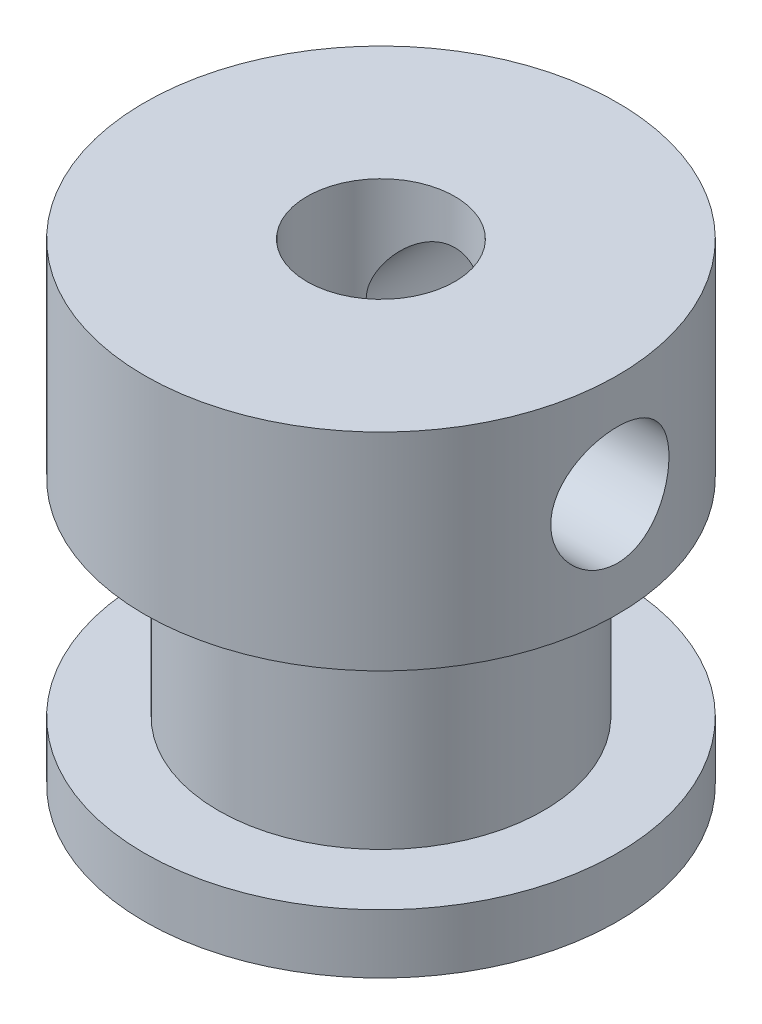
ISO-10303-21;
HEADER;
FILE_DESCRIPTION(('STEP AP214'),'2;1');
FILE_NAME('part.step','',(''),(''),'','','');
FILE_SCHEMA(('AUTOMOTIVE_DESIGN { 1 0 10303 214 1 1 1 1 }'));
ENDSEC;
DATA;
#1=APPLICATION_CONTEXT('core data for automotive mechanical design processes');
#2=APPLICATION_PROTOCOL_DEFINITION('international standard','automotive_design',2000,#1);
#3=PRODUCT_CONTEXT('',#1,'mechanical');
#4=PRODUCT('Part','Part','',(#3));
#5=PRODUCT_RELATED_PRODUCT_CATEGORY('part','',(#4));
#6=PRODUCT_DEFINITION_FORMATION('','',#4);
#7=PRODUCT_DEFINITION_CONTEXT('part definition',#1,'design');
#8=PRODUCT_DEFINITION('design','',#6,#7);
#9=PRODUCT_DEFINITION_SHAPE('','',#8);
#10=(LENGTH_UNIT() NAMED_UNIT(*) SI_UNIT(.MILLI.,.METRE.));
#11=(NAMED_UNIT(*) PLANE_ANGLE_UNIT() SI_UNIT($,.RADIAN.));
#12=(NAMED_UNIT(*) SI_UNIT($,.STERADIAN.) SOLID_ANGLE_UNIT());
#13=UNCERTAINTY_MEASURE_WITH_UNIT(LENGTH_MEASURE(1.E-05),#10,'distance_accuracy_value','');
#14=(GEOMETRIC_REPRESENTATION_CONTEXT(3) GLOBAL_UNCERTAINTY_ASSIGNED_CONTEXT((#13)) GLOBAL_UNIT_ASSIGNED_CONTEXT((#10,
#11,#12)) REPRESENTATION_CONTEXT('',''));
#15=CARTESIAN_POINT('',(0.,0.,0.));
#16=DIRECTION('',(0.,0.,1.));
#17=DIRECTION('',(1.,0.,0.));
#18=AXIS2_PLACEMENT_3D('',#15,#16,#17);
#19=CARTESIAN_POINT('',(0.,2.,0.));
#20=DIRECTION('',(0.,-1.,0.));
#21=DIRECTION('',(0.,0.,-1.));
#22=AXIS2_PLACEMENT_3D('',#19,#20,#21);
#23=CYLINDRICAL_SURFACE('',#22,8.);
#24=CARTESIAN_POINT('',(0.,2.,0.));
#25=DIRECTION('',(0.,1.,0.));
#26=DIRECTION('',(0.,0.,1.));
#27=AXIS2_PLACEMENT_3D('',#24,#25,#26);
#28=CIRCLE('',#27,8.);
#29=CARTESIAN_POINT('',(0.,2.,8.));
#30=VERTEX_POINT('',#29);
#31=EDGE_CURVE('E125',#30,#30,#28,.T.);
#32=ORIENTED_EDGE('',*,*,#31,.F.);
#33=EDGE_LOOP('',(#32));
#34=FACE_BOUND('',#33,.T.);
#35=CARTESIAN_POINT('',(0.,0.,0.));
#36=DIRECTION('',(0.,1.,0.));
#37=DIRECTION('',(0.,0.,1.));
#38=AXIS2_PLACEMENT_3D('',#35,#36,#37);
#39=CIRCLE('',#38,8.);
#40=CARTESIAN_POINT('',(0.,0.,8.));
#41=VERTEX_POINT('',#40);
#42=EDGE_CURVE('E76',#41,#41,#39,.T.);
#43=ORIENTED_EDGE('',*,*,#42,.T.);
#44=EDGE_LOOP('',(#43));
#45=FACE_BOUND('',#44,.T.);
#46=ADVANCED_FACE('F37',(#34,#45),#23,.T.);
#47=CARTESIAN_POINT('',(0.,2.,0.));
#48=DIRECTION('',(0.,1.,0.));
#49=DIRECTION('',(0.,0.,1.));
#50=AXIS2_PLACEMENT_3D('',#47,#48,#49);
#51=PLANE('',#50);
#52=CARTESIAN_POINT('',(0.,2.,0.));
#53=DIRECTION('',(0.,1.,0.));
#54=DIRECTION('',(0.,0.,1.));
#55=AXIS2_PLACEMENT_3D('',#52,#53,#54);
#56=CIRCLE('',#55,5.5);
#57=CARTESIAN_POINT('',(0.,2.,5.5));
#58=VERTEX_POINT('',#57);
#59=EDGE_CURVE('E44',#58,#58,#56,.T.);
#60=ORIENTED_EDGE('',*,*,#59,.F.);
#61=EDGE_LOOP('',(#60));
#62=FACE_BOUND('',#61,.T.);
#63=ORIENTED_EDGE('',*,*,#31,.T.);
#64=EDGE_LOOP('',(#63));
#65=FACE_BOUND('',#64,.T.);
#66=ADVANCED_FACE('F109',(#62,#65),#51,.T.);
#67=CARTESIAN_POINT('',(0.,0.,0.));
#68=DIRECTION('',(0.,1.,0.));
#69=DIRECTION('',(0.,0.,1.));
#70=AXIS2_PLACEMENT_3D('',#67,#68,#69);
#71=PLANE('',#70);
#72=CARTESIAN_POINT('',(0.,0.,0.));
#73=DIRECTION('',(0.,1.,0.));
#74=DIRECTION('',(0.,0.,1.));
#75=AXIS2_PLACEMENT_3D('',#72,#73,#74);
#76=CIRCLE('',#75,2.5);
#77=CARTESIAN_POINT('',(0.,0.,2.5));
#78=VERTEX_POINT('',#77);
#79=EDGE_CURVE('E93',#78,#78,#76,.T.);
#80=ORIENTED_EDGE('',*,*,#79,.T.);
#81=EDGE_LOOP('',(#80));
#82=FACE_BOUND('',#81,.T.);
#83=ORIENTED_EDGE('',*,*,#42,.F.);
#84=EDGE_LOOP('',(#83));
#85=FACE_BOUND('',#84,.T.);
#86=ADVANCED_FACE('F107',(#82,#85),#71,.F.);
#87=CARTESIAN_POINT('',(0.,9.,0.));
#88=DIRECTION('',(0.,-1.,0.));
#89=DIRECTION('',(0.,0.,-1.));
#90=AXIS2_PLACEMENT_3D('',#87,#88,#89);
#91=CYLINDRICAL_SURFACE('',#90,5.5);
#92=CARTESIAN_POINT('',(0.,9.,0.));
#93=DIRECTION('',(0.,1.,0.));
#94=DIRECTION('',(0.,0.,1.));
#95=AXIS2_PLACEMENT_3D('',#92,#93,#94);
#96=CIRCLE('',#95,5.5);
#97=CARTESIAN_POINT('',(0.,9.,5.5));
#98=VERTEX_POINT('',#97);
#99=EDGE_CURVE('E128',#98,#98,#96,.T.);
#100=ORIENTED_EDGE('',*,*,#99,.F.);
#101=EDGE_LOOP('',(#100));
#102=FACE_BOUND('',#101,.T.);
#103=ORIENTED_EDGE('',*,*,#59,.T.);
#104=EDGE_LOOP('',(#103));
#105=FACE_BOUND('',#104,.T.);
#106=ADVANCED_FACE('F101',(#102,#105),#91,.T.);
#107=CARTESIAN_POINT('',(0.,16.,0.));
#108=DIRECTION('',(0.,-1.,0.));
#109=DIRECTION('',(0.,0.,-1.));
#110=AXIS2_PLACEMENT_3D('',#107,#108,#109);
#111=CYLINDRICAL_SURFACE('',#110,8.);
#112=CARTESIAN_POINT('',(8.00000000000003,10.5,0.));
#113=CARTESIAN_POINT('',(7.99999813157352,10.5000031009842,0.110501451559669));
#114=CARTESIAN_POINT('',(7.99768770842436,10.5091887343651,0.221037543774378));
#115=CARTESIAN_POINT('',(7.98869485106525,10.545633535076,0.438941765027404));
#116=CARTESIAN_POINT('',(7.98200993893301,10.5729029460505,0.546308062494346));
#117=CARTESIAN_POINT('',(7.96500835109376,10.6445856712828,0.754694496243463));
#118=CARTESIAN_POINT('',(7.95469603789411,10.688978398287,0.855722084573363));
#119=CARTESIAN_POINT('',(7.93153791743495,10.7935751867265,1.0488961758726));
#120=CARTESIAN_POINT('',(7.91869202472208,10.853779781492,1.14104237913171));
#121=CARTESIAN_POINT('',(7.8915655145559,10.9896010528722,1.31573590306791));
#122=CARTESIAN_POINT('',(7.87726276197501,11.0654820999454,1.39807425341477));
#123=CARTESIAN_POINT('',(7.84898160157248,11.229936273212,1.54899856960445));
#124=CARTESIAN_POINT('',(7.83500323053156,11.3185108305959,1.61758298259895));
#125=CARTESIAN_POINT('',(7.80873034264224,11.507460302316,1.74003539039866));
#126=CARTESIAN_POINT('',(7.79646392619747,11.6079909744116,1.79366962123355));
#127=CARTESIAN_POINT('',(7.77532659757355,11.8169978822134,1.88319587806768));
#128=CARTESIAN_POINT('',(7.76645514259224,11.9254728444427,1.91909074058688));
#129=CARTESIAN_POINT('',(7.7533396892843,12.1449913309355,1.97140644907305));
#130=CARTESIAN_POINT('',(7.74900654662681,12.255939861384,1.98820302444276));
#131=CARTESIAN_POINT('',(7.74519149946121,12.4791580919991,2.00301570008857));
#132=CARTESIAN_POINT('',(7.74570880570571,12.5914275742562,2.00103485575751));
#133=CARTESIAN_POINT('',(7.75145607355755,12.8112210769938,1.97864869951963));
#134=CARTESIAN_POINT('',(7.75657150676391,12.9187941619538,1.95869112025421));
#135=CARTESIAN_POINT('',(7.77075612894758,13.1290147345481,1.90163224920402));
#136=CARTESIAN_POINT('',(7.77982559958984,13.2316618707052,1.86452973609255));
#137=CARTESIAN_POINT('',(7.80100151874211,13.4303173550028,1.77385263724961));
#138=CARTESIAN_POINT('',(7.81313769959754,13.5262482290528,1.72011555631059));
#139=CARTESIAN_POINT('',(7.83906281127987,13.7078916130091,1.59780836801996));
#140=CARTESIAN_POINT('',(7.85285203112837,13.7936023307563,1.52923566507848));
#141=CARTESIAN_POINT('',(7.88101174053188,13.9549381542592,1.37688456624165));
#142=CARTESIAN_POINT('',(7.89538759304001,14.0302059867485,1.29272834422117));
#143=CARTESIAN_POINT('',(7.92274620771675,14.1656283232852,1.11281589000496));
#144=CARTESIAN_POINT('',(7.93572892732543,14.2257823656848,1.01705930361062));
#145=CARTESIAN_POINT('',(7.9589030945892,14.3294007816325,0.816154518241884));
#146=CARTESIAN_POINT('',(7.96908480170303,14.3728071203392,0.71097519094486));
#147=CARTESIAN_POINT('',(7.98543889321888,14.4412230742794,0.494501344190539));
#148=CARTESIAN_POINT('',(7.99161204452373,14.4662362085575,0.383207998867342));
#149=CARTESIAN_POINT('',(7.999139990285,14.4966100874118,0.160719960520065));
#150=CARTESIAN_POINT('',(8.00061404677705,14.5024573681004,0.0495956266509754));
#151=CARTESIAN_POINT('',(7.99891739752601,14.4956679972594,-0.172043833068648));
#152=CARTESIAN_POINT('',(7.99574710989129,14.4830330096012,-0.282559012859431));
#153=CARTESIAN_POINT('',(7.98519441503143,14.4400387888115,-0.498152358368626));
#154=CARTESIAN_POINT('',(7.97787512247749,14.4099449820307,-0.603286825291644));
#155=CARTESIAN_POINT('',(7.95984942178846,14.3331905546287,-0.807009723269986));
#156=CARTESIAN_POINT('',(7.94914267159857,14.2865282609158,-0.905597492043484));
#157=CARTESIAN_POINT('',(7.92524410568414,14.1770184948337,-1.09536417923977));
#158=CARTESIAN_POINT('',(7.91201156489243,14.1138985168043,-1.18638058911441));
#159=CARTESIAN_POINT('',(7.88459345583226,13.9736134549374,-1.3567021515243));
#160=CARTESIAN_POINT('',(7.87040772335607,13.8964459471775,-1.43600527863065));
#161=CARTESIAN_POINT('',(7.84225275947695,13.7279973855407,-1.58265409076361));
#162=CARTESIAN_POINT('',(7.82829738916375,13.6364163959968,-1.64965849016268));
#163=CARTESIAN_POINT('',(7.80257171169652,13.4430231540457,-1.76734767868357));
#164=CARTESIAN_POINT('',(7.79080130756035,13.3412113560537,-1.81803319221055));
#165=CARTESIAN_POINT('',(7.77090792979554,13.1307923701159,-1.90126856081236));
#166=CARTESIAN_POINT('',(7.76276340389208,13.0222298288747,-1.93392586220539));
#167=CARTESIAN_POINT('',(7.75102325453579,12.8009204828145,-1.98046087993834));
#168=CARTESIAN_POINT('',(7.74742663626582,12.6881745986233,-1.99434270330485));
#169=CARTESIAN_POINT('',(7.7452653493861,12.4651719681931,-2.0027181204453));
#170=CARTESIAN_POINT('',(7.74655910304352,12.354936753167,-1.99775719704013));
#171=CARTESIAN_POINT('',(7.75370545343791,12.1369281484427,-1.9698363710838));
#172=CARTESIAN_POINT('',(7.7595579585581,12.0291547093151,-1.946876830249));
#173=CARTESIAN_POINT('',(7.77508347576964,11.8197220545795,-1.8839084259237));
#174=CARTESIAN_POINT('',(7.78473353648413,11.7180302596797,-1.84400187290714));
#175=CARTESIAN_POINT('',(7.80677007633105,11.5227128230484,-1.74835321814007));
#176=CARTESIAN_POINT('',(7.81915693494365,11.4290883024174,-1.69260892004556));
#177=CARTESIAN_POINT('',(7.8456751235135,11.2499271613306,-1.56515699818282));
#178=CARTESIAN_POINT('',(7.8598435310901,11.1646652354347,-1.49307088388298));
#179=CARTESIAN_POINT('',(7.88810702995048,11.0072706069395,-1.33571916158629));
#180=CARTESIAN_POINT('',(7.90220210302747,10.935141026516,-1.25045042834817));
#181=CARTESIAN_POINT('',(7.92903540863551,10.8047849219139,-1.06729011560343));
#182=CARTESIAN_POINT('',(7.94174444487824,10.7468338484379,-0.969197896421822));
#183=CARTESIAN_POINT('',(7.96406566633491,10.6483367160793,-0.764354746013941));
#184=CARTESIAN_POINT('',(7.97368006933042,10.607778185802,-0.657610084582292));
#185=CARTESIAN_POINT('',(7.98730746087389,10.5512375595605,-0.459213670991268));
#186=CARTESIAN_POINT('',(7.9920344673692,10.5320650092621,-0.368506894544063));
#187=CARTESIAN_POINT('',(7.99838140309265,10.5064454085041,-0.185208095381683));
#188=CARTESIAN_POINT('',(8.00000156601195,10.4999974009263,-0.092616214990127));
#189=CARTESIAN_POINT('',(8.00000000000003,10.5,0.));
#190=B_SPLINE_CURVE_WITH_KNOTS('',3,(#112,#113,#114,#115,#116,#117,#118,#119,#120,#121,#122,
#123,#124,#125,#126,#127,#128,#129,#130,#131,#132,#133,#134,#135,#136,#137,#138,#139,#140,#141,
#142,#143,#144,#145,#146,#147,#148,#149,#150,#151,#152,#153,#154,#155,#156,#157,#158,#159,#160,
#161,#162,#163,#164,#165,#166,#167,#168,#169,#170,#171,#172,#173,#174,#175,#176,#177,#178,#179,
#180,#181,#182,#183,#184,#185,#186,#187,#188,#189),.UNSPECIFIED.,.T.,.F.,(4,2,2,2,2,2,2,2,2,2,2,
2,2,2,2,2,2,2,2,2,2,2,2,2,2,2,2,2,2,2,2,2,2,2,2,2,2,2,4),(0.,0.331164949962519,
0.662517650351866,0.993473203048142,1.32443992022577,1.66152580582852,1.99864972773416,
2.34078196727742,2.68285948225824,3.01808393468093,3.3532538415469,3.68029996013785,
4.00736937959145,4.337740371696,4.66816921119311,5.00802001296453,5.34788119415424,
5.68890972016579,6.02987298255951,6.36211078603462,6.69431868154751,7.02160366023144,
7.34892169767481,7.68204783424897,8.01523150681786,8.35659345610395,8.69794025003772,
9.03723006156476,9.37644564340971,9.70591707202577,10.0353818794581,10.3628853408369,
10.6904342418696,11.0265276855097,11.3627009303165,11.7049624733721,12.0469781843289,
12.3245632392729,12.6021274139515),.UNSPECIFIED.);
#191=CARTESIAN_POINT('',(8.00000000000003,10.5,0.));
#192=VERTEX_POINT('',#191);
#193=EDGE_CURVE('E60',#192,#192,#190,.T.);
#194=ORIENTED_EDGE('',*,*,#193,.T.);
#195=EDGE_LOOP('',(#194));
#196=FACE_BOUND('',#195,.T.);
#197=CARTESIAN_POINT('',(0.,14.5,-8.));
#198=CARTESIAN_POINT('',(-0.110501451559641,14.4999968990158,-7.9999981315735));
#199=CARTESIAN_POINT('',(-0.221037543774351,14.490811265635,-7.99768770842435));
#200=CARTESIAN_POINT('',(-0.438941765027377,14.454366464924,-7.98869485106526));
#201=CARTESIAN_POINT('',(-0.546308062494319,14.4270970539495,-7.98200993893301));
#202=CARTESIAN_POINT('',(-0.754694496243435,14.3554143287172,-7.96500835109376));
#203=CARTESIAN_POINT('',(-0.855722084573335,14.311021601713,-7.95469603789411));
#204=CARTESIAN_POINT('',(-1.04889617587257,14.2064248132735,-7.93153791743495));
#205=CARTESIAN_POINT('',(-1.14104237913168,14.146220218508,-7.91869202472209));
#206=CARTESIAN_POINT('',(-1.31573590306789,14.0103989471278,-7.89156551455591));
#207=CARTESIAN_POINT('',(-1.39807425341474,13.9345179000546,-7.87726276197502));
#208=CARTESIAN_POINT('',(-1.54899856960443,13.770063726788,-7.84898160157248));
#209=CARTESIAN_POINT('',(-1.61758298259892,13.6814891694041,-7.83500323053157));
#210=CARTESIAN_POINT('',(-1.74003539039863,13.492539697684,-7.80873034264225));
#211=CARTESIAN_POINT('',(-1.79366962123352,13.3920090255884,-7.79646392619748));
#212=CARTESIAN_POINT('',(-1.88319587806766,13.1830021177866,-7.77532659757355));
#213=CARTESIAN_POINT('',(-1.91909074058685,13.0745271555573,-7.76645514259224));
#214=CARTESIAN_POINT('',(-1.97140644907302,12.8550086690645,-7.7533396892843));
#215=CARTESIAN_POINT('',(-1.98820302444274,12.744060138616,-7.74900654662681));
#216=CARTESIAN_POINT('',(-2.00301570008854,12.5208419080009,-7.74519149946122));
#217=CARTESIAN_POINT('',(-2.00103485575748,12.4085724257438,-7.74570880570571));
#218=CARTESIAN_POINT('',(-1.97864869951961,12.1887789230062,-7.75145607355756));
#219=CARTESIAN_POINT('',(-1.95869112025418,12.0812058380462,-7.75657150676391));
#220=CARTESIAN_POINT('',(-1.90163224920399,11.8709852654519,-7.77075612894758));
#221=CARTESIAN_POINT('',(-1.86452973609252,11.7683381292948,-7.77982559958985));
#222=CARTESIAN_POINT('',(-1.77385263724958,11.5696826449972,-7.80100151874212));
#223=CARTESIAN_POINT('',(-1.72011555631056,11.4737517709472,-7.81313769959755));
#224=CARTESIAN_POINT('',(-1.59780836801993,11.2921083869909,-7.83906281127988));
#225=CARTESIAN_POINT('',(-1.52923566507845,11.2063976692437,-7.85285203112837));
#226=CARTESIAN_POINT('',(-1.37688456624163,11.0450618457408,-7.88101174053188));
#227=CARTESIAN_POINT('',(-1.29272834422115,10.9697940132515,-7.89538759304001));
#228=CARTESIAN_POINT('',(-1.11281589000493,10.8343716767148,-7.92274620771675));
#229=CARTESIAN_POINT('',(-1.01705930361059,10.7742176343152,-7.93572892732543));
#230=CARTESIAN_POINT('',(-0.816154518241856,10.6705992183675,-7.9589030945892));
#231=CARTESIAN_POINT('',(-0.710975190944832,10.6271928796608,-7.96908480170303));
#232=CARTESIAN_POINT('',(-0.494501344190511,10.5587769257206,-7.98543889321888));
#233=CARTESIAN_POINT('',(-0.383207998867313,10.5337637914425,-7.99161204452374));
#234=CARTESIAN_POINT('',(-0.160719960520036,10.5033899125882,-7.999139990285));
#235=CARTESIAN_POINT('',(-0.0495956266509467,10.4975426318996,-8.00061404677705));
#236=CARTESIAN_POINT('',(0.172043833068677,10.5043320027407,-7.99891739752601));
#237=CARTESIAN_POINT('',(0.28255901285946,10.5169669903988,-7.99574710989128));
#238=CARTESIAN_POINT('',(0.498152358368655,10.5599612111885,-7.98519441503143));
#239=CARTESIAN_POINT('',(0.603286825291673,10.5900550179693,-7.97787512247748));
#240=CARTESIAN_POINT('',(0.807009723270015,10.6668094453713,-7.95984942178845));
#241=CARTESIAN_POINT('',(0.905597492043513,10.7134717390842,-7.94914267159856));
#242=CARTESIAN_POINT('',(1.0953641792398,10.8229815051663,-7.92524410568414));
#243=CARTESIAN_POINT('',(1.18638058911444,10.8861014831957,-7.91201156489243));
#244=CARTESIAN_POINT('',(1.35670215152433,11.0263865450626,-7.88459345583226));
#245=CARTESIAN_POINT('',(1.43600527863068,11.1035540528225,-7.87040772335606));
#246=CARTESIAN_POINT('',(1.58265409076364,11.2720026144593,-7.84225275947695));
#247=CARTESIAN_POINT('',(1.64965849016271,11.3635836040032,-7.82829738916375));
#248=CARTESIAN_POINT('',(1.7673476786836,11.5569768459543,-7.80257171169652));
#249=CARTESIAN_POINT('',(1.81803319221058,11.6587886439463,-7.79080130756035));
#250=CARTESIAN_POINT('',(1.90126856081239,11.8692076298841,-7.77090792979553));
#251=CARTESIAN_POINT('',(1.93392586220542,11.9777701711253,-7.76276340389207));
#252=CARTESIAN_POINT('',(1.98046087993837,12.1990795171855,-7.75102325453578));
#253=CARTESIAN_POINT('',(1.99434270330488,12.3118254013767,-7.74742663626581));
#254=CARTESIAN_POINT('',(2.00271812044533,12.5348280318069,-7.74526534938609));
#255=CARTESIAN_POINT('',(1.99775719704016,12.645063246833,-7.74655910304351));
#256=CARTESIAN_POINT('',(1.96983637108382,12.8630718515573,-7.7537054534379));
#257=CARTESIAN_POINT('',(1.94687683024903,12.9708452906849,-7.75955795855809));
#258=CARTESIAN_POINT('',(1.88390842592373,13.1802779454205,-7.77508347576963));
#259=CARTESIAN_POINT('',(1.84400187290717,13.2819697403203,-7.78473353648412));
#260=CARTESIAN_POINT('',(1.74835321814009,13.4772871769516,-7.80677007633105));
#261=CARTESIAN_POINT('',(1.69260892004558,13.5709116975826,-7.81915693494364));
#262=CARTESIAN_POINT('',(1.56515699818285,13.7500728386694,-7.8456751235135));
#263=CARTESIAN_POINT('',(1.49307088388301,13.8353347645653,-7.85984353109009));
#264=CARTESIAN_POINT('',(1.33571916158631,13.9927293930605,-7.88810702995048));
#265=CARTESIAN_POINT('',(1.25045042834819,14.064858973484,-7.90220210302746));
#266=CARTESIAN_POINT('',(1.06729011560345,14.1952150780861,-7.92903540863551));
#267=CARTESIAN_POINT('',(0.969197896421849,14.2531661515621,-7.94174444487824));
#268=CARTESIAN_POINT('',(0.764354746013968,14.3516632839207,-7.96406566633491));
#269=CARTESIAN_POINT('',(0.657610084582319,14.392221814198,-7.97368006933042));
#270=CARTESIAN_POINT('',(0.459213670991295,14.4487624404395,-7.98730746087389));
#271=CARTESIAN_POINT('',(0.368506894544091,14.4679349907379,-7.9920344673692));
#272=CARTESIAN_POINT('',(0.18520809538171,14.4935545914959,-7.99838140309264));
#273=CARTESIAN_POINT('',(0.0926162149901548,14.5000025990737,-8.00000156601192));
#274=CARTESIAN_POINT('',(0.,14.5,-8.));
#275=B_SPLINE_CURVE_WITH_KNOTS('',3,(#197,#198,#199,#200,#201,#202,#203,#204,#205,#206,#207,
#208,#209,#210,#211,#212,#213,#214,#215,#216,#217,#218,#219,#220,#221,#222,#223,#224,#225,#226,
#227,#228,#229,#230,#231,#232,#233,#234,#235,#236,#237,#238,#239,#240,#241,#242,#243,#244,#245,
#246,#247,#248,#249,#250,#251,#252,#253,#254,#255,#256,#257,#258,#259,#260,#261,#262,#263,#264,
#265,#266,#267,#268,#269,#270,#271,#272,#273,#274),.UNSPECIFIED.,.T.,.F.,(4,2,2,2,2,2,2,2,2,2,2,
2,2,2,2,2,2,2,2,2,2,2,2,2,2,2,2,2,2,2,2,2,2,2,2,2,2,2,4),(0.,0.331164949962519,
0.662517650351866,0.99347320304814,1.32443992022577,1.66152580582852,1.99864972773416,
2.34078196727742,2.68285948225824,3.01808393468093,3.3532538415469,3.68029996013785,
4.00736937959146,4.337740371696,4.66816921119311,5.00802001296453,5.34788119415424,
5.68890972016579,6.02987298255951,6.36211078603462,6.69431868154751,7.02160366023144,
7.34892169767481,7.68204783424897,8.01523150681786,8.35659345610395,8.69794025003772,
9.03723006156476,9.37644564340971,9.70591707202578,10.0353818794581,10.3628853408369,
10.6904342418696,11.0265276855097,11.3627009303165,11.7049624733721,12.0469781843289,
12.3245632392729,12.6021274139515),.UNSPECIFIED.);
#276=CARTESIAN_POINT('',(0.,14.5,-8.));
#277=VERTEX_POINT('',#276);
#278=EDGE_CURVE('E64',#277,#277,#275,.T.);
#279=ORIENTED_EDGE('',*,*,#278,.T.);
#280=EDGE_LOOP('',(#279));
#281=FACE_BOUND('',#280,.T.);
#282=CARTESIAN_POINT('',(0.,16.,0.));
#283=DIRECTION('',(0.,1.,0.));
#284=DIRECTION('',(0.,0.,1.));
#285=AXIS2_PLACEMENT_3D('',#282,#283,#284);
#286=CIRCLE('',#285,8.);
#287=CARTESIAN_POINT('',(0.,16.,8.));
#288=VERTEX_POINT('',#287);
#289=EDGE_CURVE('E130',#288,#288,#286,.T.);
#290=ORIENTED_EDGE('',*,*,#289,.F.);
#291=EDGE_LOOP('',(#290));
#292=FACE_BOUND('',#291,.T.);
#293=CARTESIAN_POINT('',(0.,9.,0.));
#294=DIRECTION('',(0.,1.,0.));
#295=DIRECTION('',(0.,0.,1.));
#296=AXIS2_PLACEMENT_3D('',#293,#294,#295);
#297=CIRCLE('',#296,8.);
#298=CARTESIAN_POINT('',(0.,9.,8.));
#299=VERTEX_POINT('',#298);
#300=EDGE_CURVE('E135',#299,#299,#297,.T.);
#301=ORIENTED_EDGE('',*,*,#300,.T.);
#302=EDGE_LOOP('',(#301));
#303=FACE_BOUND('',#302,.T.);
#304=ADVANCED_FACE('F95',(#196,#281,#292,#303),#111,.T.);
#305=CARTESIAN_POINT('',(0.,16.,0.));
#306=DIRECTION('',(0.,1.,0.));
#307=DIRECTION('',(0.,0.,1.));
#308=AXIS2_PLACEMENT_3D('',#305,#306,#307);
#309=PLANE('',#308);
#310=CARTESIAN_POINT('',(0.,16.,0.));
#311=DIRECTION('',(0.,1.,0.));
#312=DIRECTION('',(0.,0.,1.));
#313=AXIS2_PLACEMENT_3D('',#310,#311,#312);
#314=CIRCLE('',#313,2.5);
#315=CARTESIAN_POINT('',(0.,16.,2.5));
#316=VERTEX_POINT('',#315);
#317=EDGE_CURVE('E66',#316,#316,#314,.T.);
#318=ORIENTED_EDGE('',*,*,#317,.F.);
#319=EDGE_LOOP('',(#318));
#320=FACE_BOUND('',#319,.T.);
#321=ORIENTED_EDGE('',*,*,#289,.T.);
#322=EDGE_LOOP('',(#321));
#323=FACE_BOUND('',#322,.T.);
#324=ADVANCED_FACE('F100',(#320,#323),#309,.T.);
#325=CARTESIAN_POINT('',(0.,9.,0.));
#326=DIRECTION('',(0.,1.,0.));
#327=DIRECTION('',(0.,0.,1.));
#328=AXIS2_PLACEMENT_3D('',#325,#326,#327);
#329=PLANE('',#328);
#330=ORIENTED_EDGE('',*,*,#99,.T.);
#331=EDGE_LOOP('',(#330));
#332=FACE_BOUND('',#331,.T.);
#333=ORIENTED_EDGE('',*,*,#300,.F.);
#334=EDGE_LOOP('',(#333));
#335=FACE_BOUND('',#334,.T.);
#336=ADVANCED_FACE('F103',(#332,#335),#329,.F.);
#337=CARTESIAN_POINT('',(0.,0.,0.));
#338=DIRECTION('',(0.,1.,0.));
#339=DIRECTION('',(0.,0.,1.));
#340=AXIS2_PLACEMENT_3D('',#337,#338,#339);
#341=CYLINDRICAL_SURFACE('',#340,2.5);
#342=CARTESIAN_POINT('',(2.,12.5,-1.5));
#343=CARTESIAN_POINT('',(1.9999899563842,12.4249189826114,-1.5000227575991));
#344=CARTESIAN_POINT('',(1.99572243014959,12.3497210739064,-1.50575588676017));
#345=CARTESIAN_POINT('',(1.97904350434638,12.2016854705704,-1.52759797098302));
#346=CARTESIAN_POINT('',(1.96660415938922,12.1288567781879,-1.54374252679463));
#347=CARTESIAN_POINT('',(1.9288828901246,11.9623945804915,-1.59078313764401));
#348=CARTESIAN_POINT('',(1.90063587852784,11.8703574929004,-1.62485949442395));
#349=CARTESIAN_POINT('',(1.83286412912234,11.6940318598387,-1.70094533012843));
#350=CARTESIAN_POINT('',(1.79330760683741,11.6097660503329,-1.74297705283045));
#351=CARTESIAN_POINT('',(1.68777756612173,11.4196603432195,-1.84624966659378));
#352=CARTESIAN_POINT('',(1.61742363711761,11.3170334258727,-1.90894188114929));
#353=CARTESIAN_POINT('',(1.4586193506474,11.1260231647878,-2.03287996747903));
#354=CARTESIAN_POINT('',(1.37018407682201,11.0376280578861,-2.0941269976447));
#355=CARTESIAN_POINT('',(1.19476026278806,10.8928950804225,-2.1979067439451));
#356=CARTESIAN_POINT('',(1.11093376146689,10.8336737173159,-2.24174680788007));
#357=CARTESIAN_POINT('',(0.932444755507564,10.7276340400337,-2.32165152523267));
#358=CARTESIAN_POINT('',(0.837799422094952,10.6807964517991,-2.35772824500368));
#359=CARTESIAN_POINT('',(0.655317082222549,10.6082870394193,-2.41415644696378));
#360=CARTESIAN_POINT('',(0.568853585755696,10.5804174354239,-2.43610736091393));
#361=CARTESIAN_POINT('',(0.391188052921992,10.536501304746,-2.47085912284979));
#362=CARTESIAN_POINT('',(0.299988637312623,10.52044831209,-2.48366497483986));
#363=CARTESIAN_POINT('',(0.115048335136528,10.5011419067099,-2.49907968883617));
#364=CARTESIAN_POINT('',(0.0212997713727013,10.4979328073114,-2.50165324772141));
#365=CARTESIAN_POINT('',(-0.165416366428141,10.5046642348722,-2.49626936144757));
#366=CARTESIAN_POINT('',(-0.258383904122233,10.5146053703685,-2.48831142893578));
#367=CARTESIAN_POINT('',(-0.435683568436098,10.546067986313,-2.4632836571348));
#368=CARTESIAN_POINT('',(-0.520210188917499,10.5669288169561,-2.44673404857181));
#369=CARTESIAN_POINT('',(-0.684171862172426,10.6186952342522,-2.40604493660584));
#370=CARTESIAN_POINT('',(-0.76360562412977,10.6496033554976,-2.38190351809567));
#371=CARTESIAN_POINT('',(-0.923527318234433,10.7236006985885,-2.32486221996811));
#372=CARTESIAN_POINT('',(-1.00337969293305,10.7675765160147,-2.29134265660255));
#373=CARTESIAN_POINT('',(-1.15470891362336,10.8645378595917,-2.21894043646479));
#374=CARTESIAN_POINT('',(-1.22618103296473,10.9175284293631,-2.18005477975512));
#375=CARTESIAN_POINT('',(-1.37426521356107,11.0430618687988,-2.09053510980241));
#376=CARTESIAN_POINT('',(-1.44890108738507,11.1173836142049,-2.03913144290366));
#377=CARTESIAN_POINT('',(-1.58538384993671,11.2762559036507,-1.9349237792571));
#378=CARTESIAN_POINT('',(-1.6472149443604,11.3608188786743,-1.88211814269102));
#379=CARTESIAN_POINT('',(-1.75228528490804,11.5312201958179,-1.78441317626436));
#380=CARTESIAN_POINT('',(-1.79674173995946,11.6161509405137,-1.73924224553799));
#381=CARTESIAN_POINT('',(-1.87389106987978,11.7943664663345,-1.65582105773209));
#382=CARTESIAN_POINT('',(-1.90660965872838,11.8876324203376,-1.61755576516689));
#383=CARTESIAN_POINT('',(-1.95062199735974,12.0527916040278,-1.56393805143324));
#384=CARTESIAN_POINT('',(-1.96540293714784,12.1226128308979,-1.54515601955456));
#385=CARTESIAN_POINT('',(-1.98746978122375,12.2651802059541,-1.51667304681101));
#386=CARTESIAN_POINT('',(-1.99477239579985,12.3379194539107,-1.50695186390373));
#387=CARTESIAN_POINT('',(-2.0012999442642,12.4848633779274,-1.49827790293909));
#388=CARTESIAN_POINT('',(-2.00047806264257,12.5590740850574,-1.49938753445573));
#389=CARTESIAN_POINT('',(-1.99072610261057,12.7060473250374,-1.51230456185753));
#390=CARTESIAN_POINT('',(-1.98178458332098,12.7788076663875,-1.52412705251965));
#391=CARTESIAN_POINT('',(-1.95331430449204,12.9390632026618,-1.56051508430773));
#392=CARTESIAN_POINT('',(-1.9316709289088,13.0255982681308,-1.58755721486228));
#393=CARTESIAN_POINT('',(-1.87841388450525,13.1922908660855,-1.65022809339808));
#394=CARTESIAN_POINT('',(-1.84677049067316,13.2724284809031,-1.6858823654909));
#395=CARTESIAN_POINT('',(-1.75807608919816,13.4615289293493,-1.77903249993889));
#396=CARTESIAN_POINT('',(-1.69602510944931,13.5668953343252,-1.83905564347523));
#397=CARTESIAN_POINT('',(-1.55438039564658,13.764384149242,-1.96026853157683));
#398=CARTESIAN_POINT('',(-1.47476601547362,13.8564907596835,-2.02145957104429));
#399=CARTESIAN_POINT('',(-1.29702304107542,14.027462807345,-2.13993299259157));
#400=CARTESIAN_POINT('',(-1.19864860522964,14.1061226291131,-2.1971478825966));
#401=CARTESIAN_POINT('',(-0.984970277741331,14.2452665274442,-2.30083046289374));
#402=CARTESIAN_POINT('',(-0.869723203455204,14.3058096056706,-2.3473329244064));
#403=CARTESIAN_POINT('',(-0.664531994140986,14.3884905874669,-2.41163161860482));
#404=CARTESIAN_POINT('',(-0.578408265123348,14.4167173769741,-2.43384921549885));
#405=CARTESIAN_POINT('',(-0.401365381235644,14.461432134964,-2.46921550391513));
#406=CARTESIAN_POINT('',(-0.310449944179072,14.4779290645406,-2.48237111815072));
#407=CARTESIAN_POINT('',(-0.125961358052315,14.4981928241047,-2.49854699723994));
#408=CARTESIAN_POINT('',(-0.0323797561454605,14.5019132050583,-2.50153028039159));
#409=CARTESIAN_POINT('',(0.154129494971544,14.4962334907348,-2.49698719993361));
#410=CARTESIAN_POINT('',(0.247057097671179,14.4868324715917,-2.48946009629711));
#411=CARTESIAN_POINT('',(0.424484983307837,14.4563964529088,-2.46524008405095));
#412=CARTESIAN_POINT('',(0.509170159101607,14.4360106685972,-2.44905900306101));
#413=CARTESIAN_POINT('',(0.673520542356738,14.3851465786865,-2.40905201963011));
#414=CARTESIAN_POINT('',(0.75318444330352,14.354665659174,-2.3852241372675));
#415=CARTESIAN_POINT('',(0.913383591851864,14.2816254556074,-2.32886203207214));
#416=CARTESIAN_POINT('',(0.993310088153968,14.238206157889,-2.29572397002092));
#417=CARTESIAN_POINT('',(1.14486396126305,14.1423576629054,-2.22403396009593));
#418=CARTESIAN_POINT('',(1.21648689776308,14.0899236819315,-2.18547913977516));
#419=CARTESIAN_POINT('',(1.36488223995397,13.9657037869963,-2.0966685242987));
#420=CARTESIAN_POINT('',(1.4397080379364,13.8921535866846,-2.04563299169992));
#421=CARTESIAN_POINT('',(1.5766935307999,13.7348830744766,-1.9420131292006));
#422=CARTESIAN_POINT('',(1.63883728583053,13.6511501723947,-1.88942694411834));
#423=CARTESIAN_POINT('',(1.7455126136634,13.4810424554704,-1.79109125321811));
#424=CARTESIAN_POINT('',(1.79106140064658,13.3954274787839,-1.74513263017548));
#425=CARTESIAN_POINT('',(1.87016304685231,13.2156081117486,-1.66007449903139));
#426=CARTESIAN_POINT('',(1.90373836359645,13.1214202219623,-1.62096222081731));
#427=CARTESIAN_POINT('',(1.94914139922438,12.9538606732473,-1.56580101941138));
#428=CARTESIAN_POINT('',(1.96446470848963,12.8825804555928,-1.54635220628734));
#429=CARTESIAN_POINT('',(1.98726282623961,12.7369757290291,-1.51695472225641));
#430=CARTESIAN_POINT('',(1.99476751139893,12.6626639447221,-1.50696990066826));
#431=CARTESIAN_POINT('',(1.99935742227831,12.5586747856577,-1.50085460132402));
#432=CARTESIAN_POINT('',(2.00000392566845,12.5293463217565,-1.49999110491774));
#433=CARTESIAN_POINT('',(2.,12.5,-1.5));
#434=B_SPLINE_CURVE_WITH_KNOTS('',3,(#342,#343,#344,#345,#346,#347,#348,#349,#350,#351,#352,
#353,#354,#355,#356,#357,#358,#359,#360,#361,#362,#363,#364,#365,#366,#367,#368,#369,#370,#371,
#372,#373,#374,#375,#376,#377,#378,#379,#380,#381,#382,#383,#384,#385,#386,#387,#388,#389,#390,
#391,#392,#393,#394,#395,#396,#397,#398,#399,#400,#401,#402,#403,#404,#405,#406,#407,#408,#409,
#410,#411,#412,#413,#414,#415,#416,#417,#418,#419,#420,#421,#422,#423,#424,#425,#426,#427,#428,
#429,#430,#431,#432,#433),.UNSPECIFIED.,.T.,.F.,(4,2,2,2,2,2,2,2,2,2,2,2,2,2,2,2,2,2,2,2,2,2,2,
2,2,2,2,2,2,2,2,2,2,2,2,2,2,2,2,2,2,2,2,2,2,4),(0.,0.225140818813289,0.451055593895016,
0.75571438466088,1.06123795594964,1.47720804611674,1.89283253536879,2.22639303179097,
2.55943127851024,2.83862094435178,3.11765772560939,3.39765639927928,3.67766803055209,
3.94241917501297,4.20723715914625,4.49756510688428,4.78805602626152,5.13841226546404,
5.48919811771067,5.80619193384967,6.12248701337037,6.34307726284837,6.56317352160417,
6.78453876949455,7.00621641426758,7.28428560377194,7.56318925297413,7.96975811975666,
8.3768074872857,8.78961174948152,9.20105660259843,9.4798592761315,9.75844872724252,
10.0380499218877,10.3176708039936,10.5823344198312,10.8470666181456,11.1364335884202,
11.4259545900794,11.7747351905783,12.1239515037794,12.4449574092071,12.7653580273015,
12.9909138326702,13.2156045429056,13.3036035490356),.UNSPECIFIED.);
#435=CARTESIAN_POINT('',(1.76776695296637,11.5645856533065,-1.76776695296637));
#436=VERTEX_POINT('',#435);
#437=CARTESIAN_POINT('',(1.76776695296637,13.4354143466935,-1.76776695296637));
#438=VERTEX_POINT('',#437);
#439=EDGE_CURVE('E59',#436,#438,#434,.T.);
#440=ORIENTED_EDGE('',*,*,#439,.T.);
#441=CARTESIAN_POINT('',(1.49999999999999,12.5,2.00000000000001));
#442=CARTESIAN_POINT('',(1.5000227575991,12.4249189826114,1.9999899563842));
#443=CARTESIAN_POINT('',(1.50575588676016,12.3497210739064,1.99572243014959));
#444=CARTESIAN_POINT('',(1.52759797098301,12.2016854705704,1.97904350434639));
#445=CARTESIAN_POINT('',(1.54374252679463,12.1288567781879,1.96660415938923));
#446=CARTESIAN_POINT('',(1.59078313764401,11.9623945804915,1.9288828901246));
#447=CARTESIAN_POINT('',(1.62485949442394,11.8703574929004,1.90063587852784));
#448=CARTESIAN_POINT('',(1.70094533012842,11.6940318598387,1.83286412912235));
#449=CARTESIAN_POINT('',(1.74297705283045,11.6097660503329,1.79330760683741));
#450=CARTESIAN_POINT('',(1.84624966659377,11.4196603432195,1.68777756612173));
#451=CARTESIAN_POINT('',(1.90894188114929,11.3170334258727,1.61742363711761));
#452=CARTESIAN_POINT('',(2.03287996747902,11.1260231647878,1.4586193506474));
#453=CARTESIAN_POINT('',(2.0941269976447,11.0376280578861,1.37018407682201));
#454=CARTESIAN_POINT('',(2.1979067439451,10.8928950804225,1.19476026278807));
#455=CARTESIAN_POINT('',(2.24174680788007,10.8336737173159,1.1109337614669));
#456=CARTESIAN_POINT('',(2.32165152523267,10.7276340400337,0.932444755507571));
#457=CARTESIAN_POINT('',(2.35772824500367,10.6807964517991,0.837799422094958));
#458=CARTESIAN_POINT('',(2.41415644696378,10.6082870394193,0.655317082222556));
#459=CARTESIAN_POINT('',(2.43610736091392,10.5804174354239,0.568853585755701));
#460=CARTESIAN_POINT('',(2.47085912284979,10.536501304746,0.391188052921997));
#461=CARTESIAN_POINT('',(2.48366497483986,10.52044831209,0.299988637312629));
#462=CARTESIAN_POINT('',(2.49907968883617,10.5011419067099,0.115048335136533));
#463=CARTESIAN_POINT('',(2.50165324772141,10.4979328073114,0.0212997713727071));
#464=CARTESIAN_POINT('',(2.49626936144757,10.5046642348722,-0.165416366428135));
#465=CARTESIAN_POINT('',(2.48831142893578,10.5146053703685,-0.258383904122227));
#466=CARTESIAN_POINT('',(2.4632836571348,10.546067986313,-0.435683568436092));
#467=CARTESIAN_POINT('',(2.44673404857181,10.5669288169561,-0.520210188917493));
#468=CARTESIAN_POINT('',(2.40604493660584,10.6186952342522,-0.68417186217242));
#469=CARTESIAN_POINT('',(2.38190351809567,10.6496033554976,-0.763605624129764));
#470=CARTESIAN_POINT('',(2.32486221996811,10.7236006985885,-0.923527318234427));
#471=CARTESIAN_POINT('',(2.29134265660255,10.7675765160147,-1.00337969293304));
#472=CARTESIAN_POINT('',(2.21894043646479,10.8645378595917,-1.15470891362336));
#473=CARTESIAN_POINT('',(2.18005477975512,10.9175284293631,-1.22618103296472));
#474=CARTESIAN_POINT('',(2.09053510980241,11.0430618687988,-1.37426521356106));
#475=CARTESIAN_POINT('',(2.03913144290366,11.1173836142049,-1.44890108738506));
#476=CARTESIAN_POINT('',(1.9349237792571,11.2762559036507,-1.58538384993671));
#477=CARTESIAN_POINT('',(1.88211814269103,11.3608188786743,-1.6472149443604));
#478=CARTESIAN_POINT('',(1.78441317626437,11.5312201958179,-1.75228528490804));
#479=CARTESIAN_POINT('',(1.739242245538,11.6161509405137,-1.79674173995945));
#480=CARTESIAN_POINT('',(1.65582105773209,11.7943664663345,-1.87389106987978));
#481=CARTESIAN_POINT('',(1.6175557651669,11.8876324203376,-1.90660965872837));
#482=CARTESIAN_POINT('',(1.56393805143325,12.0527916040277,-1.95062199735974));
#483=CARTESIAN_POINT('',(1.54515601955457,12.1226128308979,-1.96540293714783));
#484=CARTESIAN_POINT('',(1.51667304681102,12.2651802059541,-1.98746978122375));
#485=CARTESIAN_POINT('',(1.50695186390374,12.3379194539107,-1.99477239579984));
#486=CARTESIAN_POINT('',(1.4982779029391,12.4848633779274,-2.0012999442642));
#487=CARTESIAN_POINT('',(1.49938753445574,12.5590740850574,-2.00047806264257));
#488=CARTESIAN_POINT('',(1.51230456185753,12.7060473250374,-1.99072610261057));
#489=CARTESIAN_POINT('',(1.52412705251966,12.7788076663875,-1.98178458332098));
#490=CARTESIAN_POINT('',(1.56051508430774,12.9390632026618,-1.95331430449203));
#491=CARTESIAN_POINT('',(1.58755721486229,13.0255982681308,-1.93167092890879));
#492=CARTESIAN_POINT('',(1.65022809339808,13.1922908660855,-1.87841388450525));
#493=CARTESIAN_POINT('',(1.68588236549091,13.2724284809031,-1.84677049067316));
#494=CARTESIAN_POINT('',(1.7790324999389,13.4615289293493,-1.75807608919815));
#495=CARTESIAN_POINT('',(1.83905564347524,13.5668953343252,-1.6960251094493));
#496=CARTESIAN_POINT('',(1.96026853157684,13.764384149242,-1.55438039564657));
#497=CARTESIAN_POINT('',(2.0214595710443,13.8564907596835,-1.47476601547361));
#498=CARTESIAN_POINT('',(2.13993299259158,14.027462807345,-1.29702304107541));
#499=CARTESIAN_POINT('',(2.19714788259661,14.1061226291131,-1.19864860522963));
#500=CARTESIAN_POINT('',(2.30083046289375,14.2452665274442,-0.984970277741318));
#501=CARTESIAN_POINT('',(2.34733292440641,14.3058096056706,-0.86972320345519));
#502=CARTESIAN_POINT('',(2.41163161860483,14.3884905874669,-0.664531994140972));
#503=CARTESIAN_POINT('',(2.43384921549886,14.4167173769741,-0.578408265123334));
#504=CARTESIAN_POINT('',(2.46921550391513,14.461432134964,-0.401365381235631));
#505=CARTESIAN_POINT('',(2.48237111815073,14.4779290645406,-0.310449944179058));
#506=CARTESIAN_POINT('',(2.49854699723995,14.4981928241047,-0.125961358052302));
#507=CARTESIAN_POINT('',(2.50153028039159,14.5019132050583,-0.0323797561454479));
#508=CARTESIAN_POINT('',(2.4969871999336,14.4962334907348,0.154129494971556));
#509=CARTESIAN_POINT('',(2.48946009629711,14.4868324715917,0.247057097671191));
#510=CARTESIAN_POINT('',(2.46524008405095,14.4563964529088,0.424484983307849));
#511=CARTESIAN_POINT('',(2.449059003061,14.4360106685972,0.509170159101619));
#512=CARTESIAN_POINT('',(2.4090520196301,14.3851465786865,0.673520542356749));
#513=CARTESIAN_POINT('',(2.38522413726749,14.354665659174,0.753184443303532));
#514=CARTESIAN_POINT('',(2.32886203207213,14.2816254556074,0.913383591851875));
#515=CARTESIAN_POINT('',(2.29572397002091,14.238206157889,0.993310088153979));
#516=CARTESIAN_POINT('',(2.22403396009592,14.1423576629054,1.14486396126306));
#517=CARTESIAN_POINT('',(2.18547913977515,14.0899236819315,1.21648689776309));
#518=CARTESIAN_POINT('',(2.09666852429869,13.9657037869963,1.36488223995398));
#519=CARTESIAN_POINT('',(2.04563299169992,13.8921535866846,1.43970803793641));
#520=CARTESIAN_POINT('',(1.94201312920059,13.7348830744766,1.57669353079991));
#521=CARTESIAN_POINT('',(1.88942694411833,13.6511501723947,1.63883728583054));
#522=CARTESIAN_POINT('',(1.7910912532181,13.4810424554704,1.74551261366341));
#523=CARTESIAN_POINT('',(1.74513263017547,13.3954274787839,1.79106140064659));
#524=CARTESIAN_POINT('',(1.66007449903138,13.2156081117486,1.87016304685231));
#525=CARTESIAN_POINT('',(1.6209622208173,13.1214202219623,1.90373836359645));
#526=CARTESIAN_POINT('',(1.56580101941137,12.9538606732473,1.94914139922439));
#527=CARTESIAN_POINT('',(1.54635220628733,12.8825804555928,1.96446470848964));
#528=CARTESIAN_POINT('',(1.5169547222564,12.7369757290291,1.98726282623962));
#529=CARTESIAN_POINT('',(1.50696990066825,12.6626639447221,1.99476751139894));
#530=CARTESIAN_POINT('',(1.50085460132401,12.5586747856577,1.99935742227831));
#531=CARTESIAN_POINT('',(1.49999110491774,12.5293463217565,2.00000392566845));
#532=CARTESIAN_POINT('',(1.49999999999999,12.5,2.00000000000001));
#533=B_SPLINE_CURVE_WITH_KNOTS('',3,(#441,#442,#443,#444,#445,#446,#447,#448,#449,#450,#451,
#452,#453,#454,#455,#456,#457,#458,#459,#460,#461,#462,#463,#464,#465,#466,#467,#468,#469,#470,
#471,#472,#473,#474,#475,#476,#477,#478,#479,#480,#481,#482,#483,#484,#485,#486,#487,#488,#489,
#490,#491,#492,#493,#494,#495,#496,#497,#498,#499,#500,#501,#502,#503,#504,#505,#506,#507,#508,
#509,#510,#511,#512,#513,#514,#515,#516,#517,#518,#519,#520,#521,#522,#523,#524,#525,#526,#527,
#528,#529,#530,#531,#532),.UNSPECIFIED.,.T.,.F.,(4,2,2,2,2,2,2,2,2,2,2,2,2,2,2,2,2,2,2,2,2,2,2,
2,2,2,2,2,2,2,2,2,2,2,2,2,2,2,2,2,2,2,2,2,2,4),(0.,0.225140818813289,0.451055593895016,
0.755714384660879,1.06123795594964,1.47720804611674,1.8928325353688,2.22639303179097,
2.55943127851024,2.83862094435178,3.11765772560939,3.39765639927928,3.67766803055209,
3.94241917501297,4.20723715914625,4.49756510688428,4.78805602626153,5.13841226546405,
5.48919811771067,5.80619193384967,6.12248701337037,6.34307726284837,6.56317352160417,
6.78453876949455,7.00621641426759,7.28428560377194,7.56318925297414,7.96975811975667,
8.3768074872857,8.78961174948153,9.20105660259844,9.47985927613151,9.75844872724252,
10.0380499218877,10.3176708039936,10.5823344198312,10.8470666181456,11.1364335884202,
11.4259545900794,11.7747351905783,12.1239515037794,12.4449574092071,12.7653580273015,
12.9909138326702,13.2156045429056,13.3036035490356),.UNSPECIFIED.);
#534=EDGE_CURVE('E50',#438,#436,#533,.T.);
#535=ORIENTED_EDGE('',*,*,#534,.T.);
#536=EDGE_LOOP('',(#440,#535));
#537=FACE_BOUND('',#536,.T.);
#538=ORIENTED_EDGE('',*,*,#79,.F.);
#539=EDGE_LOOP('',(#538));
#540=FACE_BOUND('',#539,.T.);
#541=ORIENTED_EDGE('',*,*,#317,.T.);
#542=EDGE_LOOP('',(#541));
#543=FACE_BOUND('',#542,.T.);
#544=ADVANCED_FACE('F57',(#537,#540,#543),#341,.F.);
#545=CARTESIAN_POINT('',(0.,12.5,-8.));
#546=DIRECTION('',(0.,0.,1.));
#547=DIRECTION('',(1.,0.,0.));
#548=AXIS2_PLACEMENT_3D('',#545,#546,#547);
#549=CYLINDRICAL_SURFACE('',#548,2.);
#550=ORIENTED_EDGE('',*,*,#439,.F.);
#551=CARTESIAN_POINT('',(0.,12.5,0.));
#552=DIRECTION('',(0.707106781186546,0.,0.707106781186549));
#553=DIRECTION('',(-0.707106781186549,0.,0.707106781186546));
#554=AXIS2_PLACEMENT_3D('',#551,#552,#553);
#555=ELLIPSE('',#554,2.82842712474619,2.);
#556=EDGE_CURVE('E11',#436,#438,#555,.T.);
#557=ORIENTED_EDGE('',*,*,#556,.T.);
#558=EDGE_LOOP('',(#550,#557));
#559=FACE_BOUND('',#558,.T.);
#560=ORIENTED_EDGE('',*,*,#278,.F.);
#561=EDGE_LOOP('',(#560));
#562=FACE_BOUND('',#561,.T.);
#563=ADVANCED_FACE('F62',(#559,#562),#549,.F.);
#564=CARTESIAN_POINT('',(8.00000000000003,12.5,0.));
#565=DIRECTION('',(-1.,0.,0.));
#566=DIRECTION('',(0.,0.,1.));
#567=AXIS2_PLACEMENT_3D('',#564,#565,#566);
#568=CYLINDRICAL_SURFACE('',#567,2.);
#569=ORIENTED_EDGE('',*,*,#556,.F.);
#570=ORIENTED_EDGE('',*,*,#534,.F.);
#571=EDGE_LOOP('',(#569,#570));
#572=FACE_BOUND('',#571,.T.);
#573=ORIENTED_EDGE('',*,*,#193,.F.);
#574=EDGE_LOOP('',(#573));
#575=FACE_BOUND('',#574,.T.);
#576=ADVANCED_FACE('F51',(#572,#575),#568,.F.);
#577=CLOSED_SHELL('',(#46,#66,#86,#106,#304,#324,#336,#544,#563,#576));
#578=MANIFOLD_SOLID_BREP('B2',#577);
#579=ADVANCED_BREP_SHAPE_REPRESENTATION('',(#18,#578),#14);
#580=SHAPE_DEFINITION_REPRESENTATION(#9,#579);
ENDSEC;
END-ISO-10303-21;
